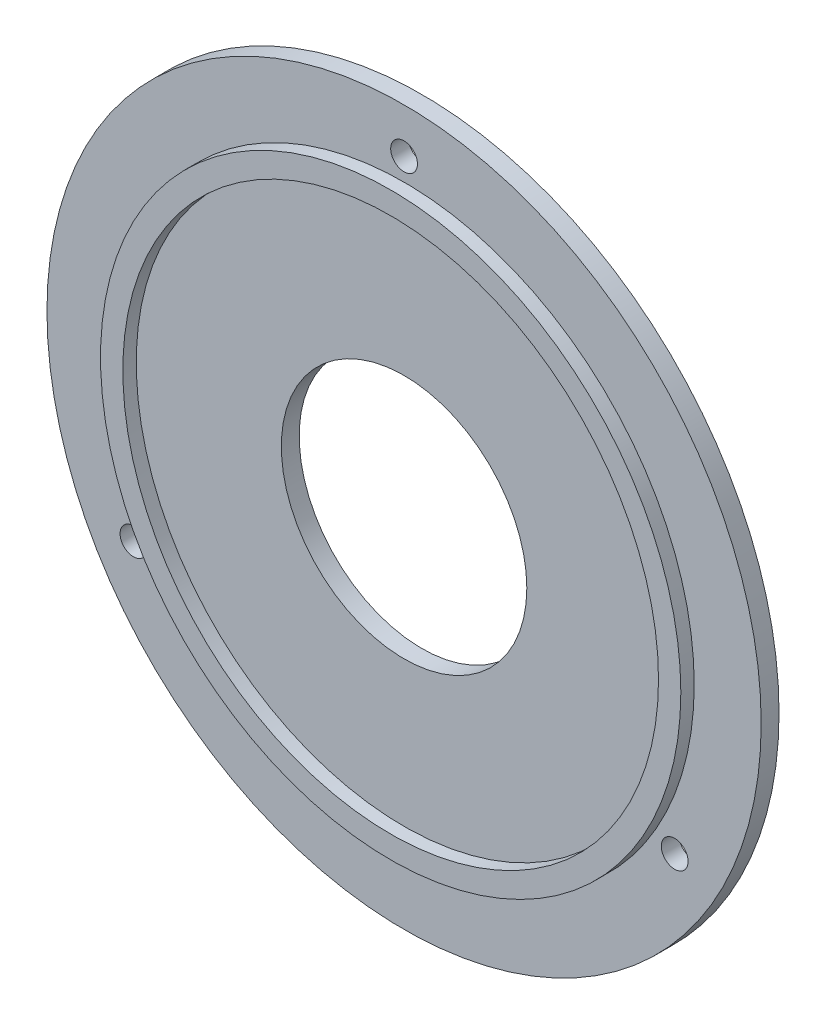
ISO-10303-21;
HEADER;
FILE_DESCRIPTION(('STEP AP214'),'2;1');
FILE_NAME('part.step','',(''),(''),'','','');
FILE_SCHEMA(('AUTOMOTIVE_DESIGN { 1 0 10303 214 1 1 1 1 }'));
ENDSEC;
DATA;
#1=APPLICATION_CONTEXT('core data for automotive mechanical design processes');
#2=APPLICATION_PROTOCOL_DEFINITION('international standard','automotive_design',2000,#1);
#3=PRODUCT_CONTEXT('',#1,'mechanical');
#4=PRODUCT('Part','Part','',(#3));
#5=PRODUCT_RELATED_PRODUCT_CATEGORY('part','',(#4));
#6=PRODUCT_DEFINITION_FORMATION('','',#4);
#7=PRODUCT_DEFINITION_CONTEXT('part definition',#1,'design');
#8=PRODUCT_DEFINITION('design','',#6,#7);
#9=PRODUCT_DEFINITION_SHAPE('','',#8);
#10=(LENGTH_UNIT() NAMED_UNIT(*) SI_UNIT(.MILLI.,.METRE.));
#11=(NAMED_UNIT(*) PLANE_ANGLE_UNIT() SI_UNIT($,.RADIAN.));
#12=(NAMED_UNIT(*) SI_UNIT($,.STERADIAN.) SOLID_ANGLE_UNIT());
#13=UNCERTAINTY_MEASURE_WITH_UNIT(LENGTH_MEASURE(1.E-05),#10,'distance_accuracy_value','');
#14=(GEOMETRIC_REPRESENTATION_CONTEXT(3) GLOBAL_UNCERTAINTY_ASSIGNED_CONTEXT((#13)) GLOBAL_UNIT_ASSIGNED_CONTEXT((#10,
#11,#12)) REPRESENTATION_CONTEXT('',''));
#15=CARTESIAN_POINT('',(0.,0.,0.));
#16=DIRECTION('',(0.,0.,1.));
#17=DIRECTION('',(1.,0.,0.));
#18=AXIS2_PLACEMENT_3D('',#15,#16,#17);
#19=CARTESIAN_POINT('',(0.,0.,4.));
#20=DIRECTION('',(0.,0.,-1.));
#21=DIRECTION('',(-1.,0.,0.));
#22=AXIS2_PLACEMENT_3D('',#19,#20,#21);
#23=CYLINDRICAL_SURFACE('',#22,80.);
#24=CARTESIAN_POINT('',(0.,0.,4.));
#25=DIRECTION('',(0.,0.,1.));
#26=DIRECTION('',(1.,0.,0.));
#27=AXIS2_PLACEMENT_3D('',#24,#25,#26);
#28=CIRCLE('',#27,80.);
#29=CARTESIAN_POINT('',(80.,0.,4.));
#30=VERTEX_POINT('',#29);
#31=EDGE_CURVE('E44',#30,#30,#28,.T.);
#32=ORIENTED_EDGE('',*,*,#31,.F.);
#33=EDGE_LOOP('',(#32));
#34=FACE_BOUND('',#33,.T.);
#35=CARTESIAN_POINT('',(0.,0.,0.));
#36=DIRECTION('',(0.,0.,1.));
#37=DIRECTION('',(1.,0.,0.));
#38=AXIS2_PLACEMENT_3D('',#35,#36,#37);
#39=CIRCLE('',#38,80.);
#40=CARTESIAN_POINT('',(80.,0.,0.));
#41=VERTEX_POINT('',#40);
#42=EDGE_CURVE('E49',#41,#41,#39,.T.);
#43=ORIENTED_EDGE('',*,*,#42,.T.);
#44=EDGE_LOOP('',(#43));
#45=FACE_BOUND('',#44,.T.);
#46=ADVANCED_FACE('F36',(#34,#45),#23,.T.);
#47=CARTESIAN_POINT('',(0.,0.,4.));
#48=DIRECTION('',(0.,0.,1.));
#49=DIRECTION('',(1.,0.,0.));
#50=AXIS2_PLACEMENT_3D('',#47,#48,#49);
#51=PLANE('',#50);
#52=CARTESIAN_POINT('',(0.,70.,4.));
#53=DIRECTION('',(0.,0.,1.));
#54=DIRECTION('',(1.,0.,0.));
#55=AXIS2_PLACEMENT_3D('',#52,#53,#54);
#56=CIRCLE('',#55,3.);
#57=CARTESIAN_POINT('',(3.,70.,4.));
#58=VERTEX_POINT('',#57);
#59=EDGE_CURVE('E67',#58,#58,#56,.T.);
#60=ORIENTED_EDGE('',*,*,#59,.F.);
#61=EDGE_LOOP('',(#60));
#62=FACE_BOUND('',#61,.T.);
#63=CARTESIAN_POINT('',(60.6217782649063,-35.0000000000026,4.));
#64=DIRECTION('',(0.,0.,1.));
#65=DIRECTION('',(1.,0.,0.));
#66=AXIS2_PLACEMENT_3D('',#63,#64,#65);
#67=CIRCLE('',#66,3.00000000000565);
#68=CARTESIAN_POINT('',(63.6217782649119,-35.0000000000026,4.));
#69=VERTEX_POINT('',#68);
#70=EDGE_CURVE('E71',#69,#69,#67,.T.);
#71=ORIENTED_EDGE('',*,*,#70,.F.);
#72=EDGE_LOOP('',(#71));
#73=FACE_BOUND('',#72,.T.);
#74=CARTESIAN_POINT('',(-60.6217782649152,-34.9999999999974,4.));
#75=DIRECTION('',(0.,0.,1.));
#76=DIRECTION('',(1.,0.,0.));
#77=AXIS2_PLACEMENT_3D('',#74,#75,#76);
#78=CIRCLE('',#77,3.00000000000388);
#79=CARTESIAN_POINT('',(-57.6217782649113,-34.9999999999974,4.));
#80=VERTEX_POINT('',#79);
#81=EDGE_CURVE('E75',#80,#80,#78,.T.);
#82=ORIENTED_EDGE('',*,*,#81,.F.);
#83=EDGE_LOOP('',(#82));
#84=FACE_BOUND('',#83,.T.);
#85=CARTESIAN_POINT('',(0.,0.,4.));
#86=DIRECTION('',(0.,0.,1.));
#87=DIRECTION('',(1.,0.,0.));
#88=AXIS2_PLACEMENT_3D('',#85,#86,#87);
#89=CIRCLE('',#88,65.);
#90=CARTESIAN_POINT('',(65.,0.,4.));
#91=VERTEX_POINT('',#90);
#92=EDGE_CURVE('E56',#91,#91,#89,.T.);
#93=ORIENTED_EDGE('',*,*,#92,.F.);
#94=EDGE_LOOP('',(#93));
#95=FACE_BOUND('',#94,.T.);
#96=ORIENTED_EDGE('',*,*,#31,.T.);
#97=EDGE_LOOP('',(#96));
#98=FACE_BOUND('',#97,.T.);
#99=ADVANCED_FACE('F115',(#62,#73,#84,#95,#98),#51,.T.);
#100=CARTESIAN_POINT('',(0.,0.,0.));
#101=DIRECTION('',(0.,0.,1.));
#102=DIRECTION('',(1.,0.,0.));
#103=AXIS2_PLACEMENT_3D('',#100,#101,#102);
#104=PLANE('',#103);
#105=CARTESIAN_POINT('',(0.,0.,0.));
#106=DIRECTION('',(0.,0.,1.));
#107=DIRECTION('',(1.,0.,0.));
#108=AXIS2_PLACEMENT_3D('',#105,#106,#107);
#109=CIRCLE('',#108,27.5);
#110=CARTESIAN_POINT('',(27.5,0.,0.));
#111=VERTEX_POINT('',#110);
#112=EDGE_CURVE('E91',#111,#111,#109,.T.);
#113=ORIENTED_EDGE('',*,*,#112,.T.);
#114=EDGE_LOOP('',(#113));
#115=FACE_BOUND('',#114,.T.);
#116=CARTESIAN_POINT('',(0.,70.,0.));
#117=DIRECTION('',(0.,0.,-1.));
#118=DIRECTION('',(-1.,0.,0.));
#119=AXIS2_PLACEMENT_3D('',#116,#117,#118);
#120=CIRCLE('',#119,3.);
#121=CARTESIAN_POINT('',(-3.,70.,0.));
#122=VERTEX_POINT('',#121);
#123=EDGE_CURVE('E79',#122,#122,#120,.T.);
#124=ORIENTED_EDGE('',*,*,#123,.F.);
#125=EDGE_LOOP('',(#124));
#126=FACE_BOUND('',#125,.T.);
#127=CARTESIAN_POINT('',(60.6217782649063,-35.0000000000026,0.));
#128=DIRECTION('',(0.,0.,-1.));
#129=DIRECTION('',(-1.,0.,0.));
#130=AXIS2_PLACEMENT_3D('',#127,#128,#129);
#131=CIRCLE('',#130,3.00000000000565);
#132=CARTESIAN_POINT('',(57.6217782649006,-35.0000000000026,0.));
#133=VERTEX_POINT('',#132);
#134=EDGE_CURVE('E84',#133,#133,#131,.T.);
#135=ORIENTED_EDGE('',*,*,#134,.F.);
#136=EDGE_LOOP('',(#135));
#137=FACE_BOUND('',#136,.T.);
#138=CARTESIAN_POINT('',(-60.6217782649152,-34.9999999999974,0.));
#139=DIRECTION('',(0.,0.,-1.));
#140=DIRECTION('',(-1.,0.,0.));
#141=AXIS2_PLACEMENT_3D('',#138,#139,#140);
#142=CIRCLE('',#141,3.00000000000388);
#143=CARTESIAN_POINT('',(-63.6217782649191,-34.9999999999974,0.));
#144=VERTEX_POINT('',#143);
#145=EDGE_CURVE('E80',#144,#144,#142,.T.);
#146=ORIENTED_EDGE('',*,*,#145,.F.);
#147=EDGE_LOOP('',(#146));
#148=FACE_BOUND('',#147,.T.);
#149=ORIENTED_EDGE('',*,*,#42,.F.);
#150=EDGE_LOOP('',(#149));
#151=FACE_BOUND('',#150,.T.);
#152=ADVANCED_FACE('F120',(#115,#126,#137,#148,#151),#104,.F.);
#153=CARTESIAN_POINT('',(0.,0.,7.));
#154=DIRECTION('',(0.,0.,1.));
#155=DIRECTION('',(1.,0.,0.));
#156=AXIS2_PLACEMENT_3D('',#153,#154,#155);
#157=PLANE('',#156);
#158=CARTESIAN_POINT('',(0.,0.,7.));
#159=DIRECTION('',(0.,0.,1.));
#160=DIRECTION('',(1.,0.,0.));
#161=AXIS2_PLACEMENT_3D('',#158,#159,#160);
#162=CIRCLE('',#161,65.);
#163=CARTESIAN_POINT('',(65.,0.,7.));
#164=VERTEX_POINT('',#163);
#165=EDGE_CURVE('E54',#164,#164,#162,.T.);
#166=ORIENTED_EDGE('',*,*,#165,.T.);
#167=EDGE_LOOP('',(#166));
#168=FACE_BOUND('',#167,.T.);
#169=CARTESIAN_POINT('',(0.,0.,7.));
#170=DIRECTION('',(0.,0.,1.));
#171=DIRECTION('',(1.,0.,0.));
#172=AXIS2_PLACEMENT_3D('',#169,#170,#171);
#173=CIRCLE('',#172,60.);
#174=CARTESIAN_POINT('',(60.,0.,7.));
#175=VERTEX_POINT('',#174);
#176=EDGE_CURVE('E60',#175,#175,#173,.T.);
#177=ORIENTED_EDGE('',*,*,#176,.F.);
#178=EDGE_LOOP('',(#177));
#179=FACE_BOUND('',#178,.T.);
#180=ADVANCED_FACE('F128',(#168,#179),#157,.T.);
#181=CARTESIAN_POINT('',(0.,0.,7.));
#182=DIRECTION('',(0.,0.,-1.));
#183=DIRECTION('',(-1.,0.,0.));
#184=AXIS2_PLACEMENT_3D('',#181,#182,#183);
#185=CYLINDRICAL_SURFACE('',#184,65.);
#186=ORIENTED_EDGE('',*,*,#165,.F.);
#187=EDGE_LOOP('',(#186));
#188=FACE_BOUND('',#187,.T.);
#189=ORIENTED_EDGE('',*,*,#92,.T.);
#190=EDGE_LOOP('',(#189));
#191=FACE_BOUND('',#190,.T.);
#192=ADVANCED_FACE('F134',(#188,#191),#185,.T.);
#193=CARTESIAN_POINT('',(0.,0.,7.));
#194=DIRECTION('',(0.,0.,-1.));
#195=DIRECTION('',(-1.,0.,0.));
#196=AXIS2_PLACEMENT_3D('',#193,#194,#195);
#197=CYLINDRICAL_SURFACE('',#196,60.);
#198=ORIENTED_EDGE('',*,*,#176,.T.);
#199=EDGE_LOOP('',(#198));
#200=FACE_BOUND('',#199,.T.);
#201=CARTESIAN_POINT('',(0.,0.,4.));
#202=DIRECTION('',(0.,0.,1.));
#203=DIRECTION('',(1.,0.,0.));
#204=AXIS2_PLACEMENT_3D('',#201,#202,#203);
#205=CIRCLE('',#204,60.);
#206=CARTESIAN_POINT('',(60.,0.,4.));
#207=VERTEX_POINT('',#206);
#208=EDGE_CURVE('E10',#207,#207,#205,.F.);
#209=ORIENTED_EDGE('',*,*,#208,.T.);
#210=EDGE_LOOP('',(#209));
#211=FACE_BOUND('',#210,.T.);
#212=ADVANCED_FACE('F140',(#200,#211),#197,.F.);
#213=CARTESIAN_POINT('',(0.,0.,4.));
#214=DIRECTION('',(0.,0.,1.));
#215=DIRECTION('',(1.,0.,0.));
#216=AXIS2_PLACEMENT_3D('',#213,#214,#215);
#217=CIRCLE('',#216,27.5);
#218=CARTESIAN_POINT('',(27.5,0.,4.));
#219=VERTEX_POINT('',#218);
#220=EDGE_CURVE('E39',#219,#219,#217,.F.);
#221=ORIENTED_EDGE('',*,*,#220,.T.);
#222=EDGE_LOOP('',(#221));
#223=FACE_BOUND('',#222,.T.);
#224=ORIENTED_EDGE('',*,*,#208,.F.);
#225=EDGE_LOOP('',(#224));
#226=FACE_BOUND('',#225,.T.);
#227=ADVANCED_FACE('F100',(#223,#226),#51,.T.);
#228=CARTESIAN_POINT('',(-60.6217782649152,-34.9999999999974,7.));
#229=DIRECTION('',(0.,0.,-1.));
#230=DIRECTION('',(-1.,0.,0.));
#231=AXIS2_PLACEMENT_3D('',#228,#229,#230);
#232=CYLINDRICAL_SURFACE('',#231,3.00000000000388);
#233=ORIENTED_EDGE('',*,*,#81,.T.);
#234=EDGE_LOOP('',(#233));
#235=FACE_BOUND('',#234,.T.);
#236=ORIENTED_EDGE('',*,*,#145,.T.);
#237=EDGE_LOOP('',(#236));
#238=FACE_BOUND('',#237,.T.);
#239=ADVANCED_FACE('F146',(#235,#238),#232,.F.);
#240=CARTESIAN_POINT('',(60.6217782649063,-35.0000000000026,7.));
#241=DIRECTION('',(0.,0.,-1.));
#242=DIRECTION('',(-1.,0.,0.));
#243=AXIS2_PLACEMENT_3D('',#240,#241,#242);
#244=CYLINDRICAL_SURFACE('',#243,3.00000000000565);
#245=ORIENTED_EDGE('',*,*,#70,.T.);
#246=EDGE_LOOP('',(#245));
#247=FACE_BOUND('',#246,.T.);
#248=ORIENTED_EDGE('',*,*,#134,.T.);
#249=EDGE_LOOP('',(#248));
#250=FACE_BOUND('',#249,.T.);
#251=ADVANCED_FACE('F111',(#247,#250),#244,.F.);
#252=CARTESIAN_POINT('',(0.,70.,7.));
#253=DIRECTION('',(0.,0.,-1.));
#254=DIRECTION('',(-1.,0.,0.));
#255=AXIS2_PLACEMENT_3D('',#252,#253,#254);
#256=CYLINDRICAL_SURFACE('',#255,3.);
#257=ORIENTED_EDGE('',*,*,#59,.T.);
#258=EDGE_LOOP('',(#257));
#259=FACE_BOUND('',#258,.T.);
#260=ORIENTED_EDGE('',*,*,#123,.T.);
#261=EDGE_LOOP('',(#260));
#262=FACE_BOUND('',#261,.T.);
#263=ADVANCED_FACE('F106',(#259,#262),#256,.F.);
#264=CARTESIAN_POINT('',(0.,0.,7.));
#265=DIRECTION('',(0.,0.,-1.));
#266=DIRECTION('',(-1.,0.,0.));
#267=AXIS2_PLACEMENT_3D('',#264,#265,#266);
#268=CYLINDRICAL_SURFACE('',#267,27.5);
#269=ORIENTED_EDGE('',*,*,#220,.F.);
#270=EDGE_LOOP('',(#269));
#271=FACE_BOUND('',#270,.T.);
#272=ORIENTED_EDGE('',*,*,#112,.F.);
#273=EDGE_LOOP('',(#272));
#274=FACE_BOUND('',#273,.T.);
#275=ADVANCED_FACE('F103',(#271,#274),#268,.F.);
#276=CLOSED_SHELL('',(#46,#99,#152,#180,#192,#212,#227,#239,#251,#263,#275));
#277=MANIFOLD_SOLID_BREP('B2',#276);
#278=ADVANCED_BREP_SHAPE_REPRESENTATION('',(#18,#277),#14);
#279=SHAPE_DEFINITION_REPRESENTATION(#9,#278);
ENDSEC;
END-ISO-10303-21;
